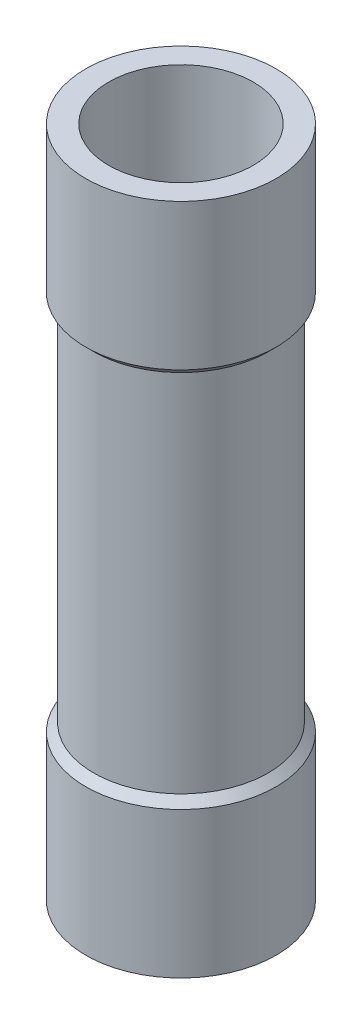
ISO-10303-21;
HEADER;
FILE_DESCRIPTION(('STEP AP214'),'2;1');
FILE_NAME('part.step','',(''),(''),'','','');
FILE_SCHEMA(('AUTOMOTIVE_DESIGN { 1 0 10303 214 1 1 1 1 }'));
ENDSEC;
DATA;
#1=APPLICATION_CONTEXT('core data for automotive mechanical design processes');
#2=APPLICATION_PROTOCOL_DEFINITION('international standard','automotive_design',2000,#1);
#3=PRODUCT_CONTEXT('',#1,'mechanical');
#4=PRODUCT('Part','Part','',(#3));
#5=PRODUCT_RELATED_PRODUCT_CATEGORY('part','',(#4));
#6=PRODUCT_DEFINITION_FORMATION('','',#4);
#7=PRODUCT_DEFINITION_CONTEXT('part definition',#1,'design');
#8=PRODUCT_DEFINITION('design','',#6,#7);
#9=PRODUCT_DEFINITION_SHAPE('','',#8);
#10=(LENGTH_UNIT() NAMED_UNIT(*) SI_UNIT(.MILLI.,.METRE.));
#11=(NAMED_UNIT(*) PLANE_ANGLE_UNIT() SI_UNIT($,.RADIAN.));
#12=(NAMED_UNIT(*) SI_UNIT($,.STERADIAN.) SOLID_ANGLE_UNIT());
#13=UNCERTAINTY_MEASURE_WITH_UNIT(LENGTH_MEASURE(1.E-05),#10,'distance_accuracy_value','');
#14=(GEOMETRIC_REPRESENTATION_CONTEXT(3) GLOBAL_UNCERTAINTY_ASSIGNED_CONTEXT((#13)) GLOBAL_UNIT_ASSIGNED_CONTEXT((#10,
#11,#12)) REPRESENTATION_CONTEXT('',''));
#15=CARTESIAN_POINT('',(0.,0.,0.));
#16=DIRECTION('',(0.,0.,1.));
#17=DIRECTION('',(1.,0.,0.));
#18=AXIS2_PLACEMENT_3D('',#15,#16,#17);
#19=CARTESIAN_POINT('',(3.81,13.462,0.));
#20=DIRECTION('',(0.,1.,0.));
#21=DIRECTION('',(0.,0.,1.));
#22=AXIS2_PLACEMENT_3D('',#19,#20,#21);
#23=PLANE('',#22);
#24=CARTESIAN_POINT('',(0.,13.462,0.));
#25=DIRECTION('',(0.,-1.,0.));
#26=DIRECTION('',(0.,0.,-1.));
#27=AXIS2_PLACEMENT_3D('',#24,#25,#26);
#28=CIRCLE('',#27,2.894);
#29=CARTESIAN_POINT('',(0.,13.462,-2.894));
#30=VERTEX_POINT('',#29);
#31=EDGE_CURVE('E11',#30,#30,#28,.T.);
#32=ORIENTED_EDGE('',*,*,#31,.T.);
#33=EDGE_LOOP('',(#32));
#34=FACE_BOUND('',#33,.T.);
#35=CARTESIAN_POINT('',(0.,13.462,0.));
#36=DIRECTION('',(0.,-1.,0.));
#37=DIRECTION('',(0.,0.,-1.));
#38=AXIS2_PLACEMENT_3D('',#35,#36,#37);
#39=CIRCLE('',#38,3.81);
#40=CARTESIAN_POINT('',(0.,13.462,-3.81));
#41=VERTEX_POINT('',#40);
#42=EDGE_CURVE('E71',#41,#41,#39,.T.);
#43=ORIENTED_EDGE('',*,*,#42,.F.);
#44=EDGE_LOOP('',(#43));
#45=FACE_BOUND('',#44,.T.);
#46=ADVANCED_FACE('F43',(#34,#45),#23,.T.);
#47=CARTESIAN_POINT('',(0.,0.,0.));
#48=DIRECTION('',(0.,-1.,0.));
#49=DIRECTION('',(0.,0.,-1.));
#50=AXIS2_PLACEMENT_3D('',#47,#48,#49);
#51=CYLINDRICAL_SURFACE('',#50,2.894);
#52=CARTESIAN_POINT('',(0.,-13.462,0.));
#53=DIRECTION('',(0.,-1.,0.));
#54=DIRECTION('',(0.,0.,-1.));
#55=AXIS2_PLACEMENT_3D('',#52,#53,#54);
#56=CIRCLE('',#55,2.894);
#57=CARTESIAN_POINT('',(0.,-13.462,-2.894));
#58=VERTEX_POINT('',#57);
#59=EDGE_CURVE('E49',#58,#58,#56,.T.);
#60=ORIENTED_EDGE('',*,*,#59,.T.);
#61=EDGE_LOOP('',(#60));
#62=FACE_BOUND('',#61,.T.);
#63=ORIENTED_EDGE('',*,*,#31,.F.);
#64=EDGE_LOOP('',(#63));
#65=FACE_BOUND('',#64,.T.);
#66=ADVANCED_FACE('F79',(#62,#65),#51,.F.);
#67=CARTESIAN_POINT('',(2.894,-13.462,0.));
#68=DIRECTION('',(0.,-1.,0.));
#69=DIRECTION('',(0.,0.,-1.));
#70=AXIS2_PLACEMENT_3D('',#67,#68,#69);
#71=PLANE('',#70);
#72=CARTESIAN_POINT('',(0.,-13.462,0.));
#73=DIRECTION('',(0.,-1.,0.));
#74=DIRECTION('',(0.,0.,-1.));
#75=AXIS2_PLACEMENT_3D('',#72,#73,#74);
#76=CIRCLE('',#75,3.81);
#77=CARTESIAN_POINT('',(0.,-13.462,-3.81));
#78=VERTEX_POINT('',#77);
#79=EDGE_CURVE('E53',#78,#78,#76,.T.);
#80=ORIENTED_EDGE('',*,*,#79,.T.);
#81=EDGE_LOOP('',(#80));
#82=FACE_BOUND('',#81,.T.);
#83=ORIENTED_EDGE('',*,*,#59,.F.);
#84=EDGE_LOOP('',(#83));
#85=FACE_BOUND('',#84,.T.);
#86=ADVANCED_FACE('F83',(#82,#85),#71,.T.);
#87=CARTESIAN_POINT('',(0.,0.,0.));
#88=DIRECTION('',(0.,-1.,0.));
#89=DIRECTION('',(0.,0.,-1.));
#90=AXIS2_PLACEMENT_3D('',#87,#88,#89);
#91=CYLINDRICAL_SURFACE('',#90,3.81);
#92=CARTESIAN_POINT('',(0.,-7.62,0.));
#93=DIRECTION('',(0.,-1.,0.));
#94=DIRECTION('',(0.,0.,-1.));
#95=AXIS2_PLACEMENT_3D('',#92,#93,#94);
#96=CIRCLE('',#95,3.81);
#97=CARTESIAN_POINT('',(0.,-7.62,-3.81));
#98=VERTEX_POINT('',#97);
#99=EDGE_CURVE('E57',#98,#98,#96,.T.);
#100=ORIENTED_EDGE('',*,*,#99,.T.);
#101=EDGE_LOOP('',(#100));
#102=FACE_BOUND('',#101,.T.);
#103=ORIENTED_EDGE('',*,*,#79,.F.);
#104=EDGE_LOOP('',(#103));
#105=FACE_BOUND('',#104,.T.);
#106=ADVANCED_FACE('F87',(#102,#105),#91,.T.);
#107=CARTESIAN_POINT('',(0.,-7.62,0.));
#108=DIRECTION('',(0.,-1.,0.));
#109=DIRECTION('',(0.,0.,-1.));
#110=AXIS2_PLACEMENT_3D('',#107,#108,#109);
#111=CONICAL_SURFACE('',#110,3.81,0.785398163397443);
#112=CARTESIAN_POINT('',(0.,-7.30249999999999,0.));
#113=DIRECTION('',(0.,-1.,0.));
#114=DIRECTION('',(0.,0.,-1.));
#115=AXIS2_PLACEMENT_3D('',#112,#113,#114);
#116=CIRCLE('',#115,3.4925);
#117=CARTESIAN_POINT('',(0.,-7.30249999999999,-3.4925));
#118=VERTEX_POINT('',#117);
#119=EDGE_CURVE('E62',#118,#118,#116,.T.);
#120=ORIENTED_EDGE('',*,*,#119,.T.);
#121=EDGE_LOOP('',(#120));
#122=FACE_BOUND('',#121,.T.);
#123=ORIENTED_EDGE('',*,*,#99,.F.);
#124=EDGE_LOOP('',(#123));
#125=FACE_BOUND('',#124,.T.);
#126=ADVANCED_FACE('F94',(#122,#125),#111,.T.);
#127=CARTESIAN_POINT('',(0.,0.,0.));
#128=DIRECTION('',(0.,-1.,0.));
#129=DIRECTION('',(0.,0.,-1.));
#130=AXIS2_PLACEMENT_3D('',#127,#128,#129);
#131=CYLINDRICAL_SURFACE('',#130,3.4925);
#132=CARTESIAN_POINT('',(0.,7.30249999999999,0.));
#133=DIRECTION('',(0.,-1.,0.));
#134=DIRECTION('',(0.,0.,-1.));
#135=AXIS2_PLACEMENT_3D('',#132,#133,#134);
#136=CIRCLE('',#135,3.4925);
#137=CARTESIAN_POINT('',(0.,7.30249999999999,-3.4925));
#138=VERTEX_POINT('',#137);
#139=EDGE_CURVE('E65',#138,#138,#136,.T.);
#140=ORIENTED_EDGE('',*,*,#139,.T.);
#141=EDGE_LOOP('',(#140));
#142=FACE_BOUND('',#141,.T.);
#143=ORIENTED_EDGE('',*,*,#119,.F.);
#144=EDGE_LOOP('',(#143));
#145=FACE_BOUND('',#144,.T.);
#146=ADVANCED_FACE('F98',(#142,#145),#131,.T.);
#147=CARTESIAN_POINT('',(0.,7.30249999999999,0.));
#148=DIRECTION('',(0.,1.,0.));
#149=DIRECTION('',(0.,0.,1.));
#150=AXIS2_PLACEMENT_3D('',#147,#148,#149);
#151=CONICAL_SURFACE('',#150,3.4925,0.785398163397443);
#152=CARTESIAN_POINT('',(0.,7.62,0.));
#153=DIRECTION('',(0.,-1.,0.));
#154=DIRECTION('',(0.,0.,-1.));
#155=AXIS2_PLACEMENT_3D('',#152,#153,#154);
#156=CIRCLE('',#155,3.81);
#157=CARTESIAN_POINT('',(0.,7.62,-3.81));
#158=VERTEX_POINT('',#157);
#159=EDGE_CURVE('E68',#158,#158,#156,.T.);
#160=ORIENTED_EDGE('',*,*,#159,.T.);
#161=EDGE_LOOP('',(#160));
#162=FACE_BOUND('',#161,.T.);
#163=ORIENTED_EDGE('',*,*,#139,.F.);
#164=EDGE_LOOP('',(#163));
#165=FACE_BOUND('',#164,.T.);
#166=ADVANCED_FACE('F102',(#162,#165),#151,.T.);
#167=CARTESIAN_POINT('',(0.,0.,0.));
#168=DIRECTION('',(0.,-1.,0.));
#169=DIRECTION('',(0.,0.,-1.));
#170=AXIS2_PLACEMENT_3D('',#167,#168,#169);
#171=CYLINDRICAL_SURFACE('',#170,3.81);
#172=ORIENTED_EDGE('',*,*,#42,.T.);
#173=EDGE_LOOP('',(#172));
#174=FACE_BOUND('',#173,.T.);
#175=ORIENTED_EDGE('',*,*,#159,.F.);
#176=EDGE_LOOP('',(#175));
#177=FACE_BOUND('',#176,.T.);
#178=ADVANCED_FACE('F75',(#174,#177),#171,.T.);
#179=CLOSED_SHELL('',(#46,#66,#86,#106,#126,#146,#166,#178));
#180=MANIFOLD_SOLID_BREP('B2',#179);
#181=CARTESIAN_POINT('',(0.,0.,0.));
#182=DIRECTION('',(0.,-1.,0.));
#183=DIRECTION('',(0.,0.,-1.));
#184=AXIS2_PLACEMENT_3D('',#181,#182,#183);
#185=CYLINDRICAL_SURFACE('',#184,2.794);
#186=CARTESIAN_POINT('',(0.,7.61999999999999,0.));
#187=DIRECTION('',(0.,-1.,0.));
#188=DIRECTION('',(0.,0.,-1.));
#189=AXIS2_PLACEMENT_3D('',#186,#187,#188);
#190=CIRCLE('',#189,2.794);
#191=CARTESIAN_POINT('',(0.,7.61999999999999,-2.794));
#192=VERTEX_POINT('',#191);
#193=EDGE_CURVE('E179',#192,#192,#190,.T.);
#194=ORIENTED_EDGE('',*,*,#193,.T.);
#195=EDGE_LOOP('',(#194));
#196=FACE_BOUND('',#195,.T.);
#197=CARTESIAN_POINT('',(0.,-7.62,0.));
#198=DIRECTION('',(0.,-1.,0.));
#199=DIRECTION('',(0.,0.,-1.));
#200=AXIS2_PLACEMENT_3D('',#197,#198,#199);
#201=CIRCLE('',#200,2.794);
#202=CARTESIAN_POINT('',(0.,-7.62,-2.794));
#203=VERTEX_POINT('',#202);
#204=EDGE_CURVE('E42',#203,#203,#201,.T.);
#205=ORIENTED_EDGE('',*,*,#204,.F.);
#206=EDGE_LOOP('',(#205));
#207=FACE_BOUND('',#206,.T.);
#208=ADVANCED_FACE('F165',(#196,#207),#185,.T.);
#209=CARTESIAN_POINT('',(1.5875,-7.62,0.));
#210=DIRECTION('',(0.,-1.,0.));
#211=DIRECTION('',(0.,0.,-1.));
#212=AXIS2_PLACEMENT_3D('',#209,#210,#211);
#213=PLANE('',#212);
#214=ORIENTED_EDGE('',*,*,#204,.T.);
#215=EDGE_LOOP('',(#214));
#216=FACE_BOUND('',#215,.T.);
#217=CARTESIAN_POINT('',(0.,-7.62,0.));
#218=DIRECTION('',(0.,-1.,0.));
#219=DIRECTION('',(0.,0.,-1.));
#220=AXIS2_PLACEMENT_3D('',#217,#218,#219);
#221=CIRCLE('',#220,1.5875);
#222=CARTESIAN_POINT('',(0.,-7.62,-1.5875));
#223=VERTEX_POINT('',#222);
#224=EDGE_CURVE('E171',#223,#223,#221,.T.);
#225=ORIENTED_EDGE('',*,*,#224,.F.);
#226=EDGE_LOOP('',(#225));
#227=FACE_BOUND('',#226,.T.);
#228=ADVANCED_FACE('F195',(#216,#227),#213,.T.);
#229=CARTESIAN_POINT('',(0.,0.,0.));
#230=DIRECTION('',(0.,-1.,0.));
#231=DIRECTION('',(0.,0.,-1.));
#232=AXIS2_PLACEMENT_3D('',#229,#230,#231);
#233=CYLINDRICAL_SURFACE('',#232,1.5875);
#234=ORIENTED_EDGE('',*,*,#224,.T.);
#235=EDGE_LOOP('',(#234));
#236=FACE_BOUND('',#235,.T.);
#237=CARTESIAN_POINT('',(0.,7.61999999999999,0.));
#238=DIRECTION('',(0.,-1.,0.));
#239=DIRECTION('',(0.,0.,-1.));
#240=AXIS2_PLACEMENT_3D('',#237,#238,#239);
#241=CIRCLE('',#240,1.5875);
#242=CARTESIAN_POINT('',(0.,7.61999999999999,-1.5875));
#243=VERTEX_POINT('',#242);
#244=EDGE_CURVE('E175',#243,#243,#241,.T.);
#245=ORIENTED_EDGE('',*,*,#244,.F.);
#246=EDGE_LOOP('',(#245));
#247=FACE_BOUND('',#246,.T.);
#248=ADVANCED_FACE('F189',(#236,#247),#233,.F.);
#249=CARTESIAN_POINT('',(1.5875,7.61999999999999,0.));
#250=DIRECTION('',(0.,1.,0.));
#251=DIRECTION('',(0.,0.,1.));
#252=AXIS2_PLACEMENT_3D('',#249,#250,#251);
#253=PLANE('',#252);
#254=ORIENTED_EDGE('',*,*,#244,.T.);
#255=EDGE_LOOP('',(#254));
#256=FACE_BOUND('',#255,.T.);
#257=ORIENTED_EDGE('',*,*,#193,.F.);
#258=EDGE_LOOP('',(#257));
#259=FACE_BOUND('',#258,.T.);
#260=ADVANCED_FACE('F187',(#256,#259),#253,.T.);
#261=CLOSED_SHELL('',(#208,#228,#248,#260));
#262=MANIFOLD_SOLID_BREP('B6',#261);
#263=ADVANCED_BREP_SHAPE_REPRESENTATION('',(#18,#180,#262),#14);
#264=SHAPE_DEFINITION_REPRESENTATION(#9,#263);
ENDSEC;
END-ISO-10303-21;
